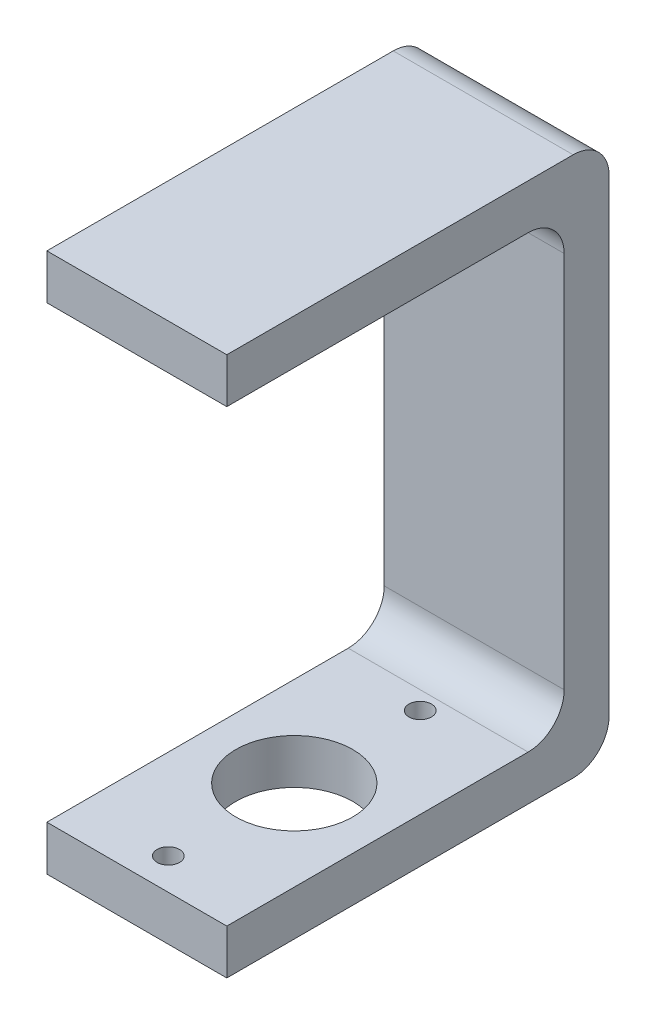
ISO-10303-21;
HEADER;
FILE_DESCRIPTION(('STEP AP214'),'2;1');
FILE_NAME('part.step','',(''),(''),'','','');
FILE_SCHEMA(('AUTOMOTIVE_DESIGN { 1 0 10303 214 1 1 1 1 }'));
ENDSEC;
DATA;
#1=APPLICATION_CONTEXT('core data for automotive mechanical design processes');
#2=APPLICATION_PROTOCOL_DEFINITION('international standard','automotive_design',2000,#1);
#3=PRODUCT_CONTEXT('',#1,'mechanical');
#4=PRODUCT('Part','Part','',(#3));
#5=PRODUCT_RELATED_PRODUCT_CATEGORY('part','',(#4));
#6=PRODUCT_DEFINITION_FORMATION('','',#4);
#7=PRODUCT_DEFINITION_CONTEXT('part definition',#1,'design');
#8=PRODUCT_DEFINITION('design','',#6,#7);
#9=PRODUCT_DEFINITION_SHAPE('','',#8);
#10=(LENGTH_UNIT() NAMED_UNIT(*) SI_UNIT(.MILLI.,.METRE.));
#11=(NAMED_UNIT(*) PLANE_ANGLE_UNIT() SI_UNIT($,.RADIAN.));
#12=(NAMED_UNIT(*) SI_UNIT($,.STERADIAN.) SOLID_ANGLE_UNIT());
#13=UNCERTAINTY_MEASURE_WITH_UNIT(LENGTH_MEASURE(1.E-05),#10,'distance_accuracy_value','');
#14=(GEOMETRIC_REPRESENTATION_CONTEXT(3) GLOBAL_UNCERTAINTY_ASSIGNED_CONTEXT((#13)) GLOBAL_UNIT_ASSIGNED_CONTEXT((#10,
#11,#12)) REPRESENTATION_CONTEXT('',''));
#15=CARTESIAN_POINT('',(0.,0.,0.));
#16=DIRECTION('',(0.,0.,1.));
#17=DIRECTION('',(1.,0.,0.));
#18=AXIS2_PLACEMENT_3D('',#15,#16,#17);
#19=CARTESIAN_POINT('',(40.,0.,0.));
#20=DIRECTION('',(0.,1.,0.));
#21=DIRECTION('',(0.,0.,1.));
#22=AXIS2_PLACEMENT_3D('',#19,#20,#21);
#23=PLANE('',#22);
#24=DIRECTION('',(0.,0.,-1.));
#25=VECTOR('',#24,1.);
#26=CARTESIAN_POINT('',(0.,0.,0.));
#27=LINE('',#26,#25);
#28=CARTESIAN_POINT('',(0.,0.,0.));
#29=VERTEX_POINT('',#28);
#30=CARTESIAN_POINT('',(0.,0.,-77.));
#31=VERTEX_POINT('',#30);
#32=EDGE_CURVE('E159',#29,#31,#27,.T.);
#33=ORIENTED_EDGE('',*,*,#32,.T.);
#34=DIRECTION('',(-1.,0.,0.));
#35=VECTOR('',#34,1.);
#36=CARTESIAN_POINT('',(40.,0.,-77.));
#37=LINE('',#36,#35);
#38=CARTESIAN_POINT('',(40.,0.,-77.));
#39=VERTEX_POINT('',#38);
#40=EDGE_CURVE('E44',#39,#31,#37,.T.);
#41=ORIENTED_EDGE('',*,*,#40,.F.);
#42=DIRECTION('',(0.,0.,-1.));
#43=VECTOR('',#42,1.);
#44=CARTESIAN_POINT('',(40.,0.,0.));
#45=LINE('',#44,#43);
#46=CARTESIAN_POINT('',(40.,0.,0.));
#47=VERTEX_POINT('',#46);
#48=EDGE_CURVE('E107',#47,#39,#45,.T.);
#49=ORIENTED_EDGE('',*,*,#48,.F.);
#50=DIRECTION('',(-1.,0.,0.));
#51=VECTOR('',#50,1.);
#52=CARTESIAN_POINT('',(40.,0.,0.));
#53=LINE('',#52,#51);
#54=EDGE_CURVE('E11',#47,#29,#53,.T.);
#55=ORIENTED_EDGE('',*,*,#54,.T.);
#56=EDGE_LOOP('',(#33,#41,#49,#55));
#57=FACE_BOUND('',#56,.T.);
#58=CARTESIAN_POINT('',(20.,0.,-35.));
#59=DIRECTION('',(0.,-1.,0.));
#60=DIRECTION('',(0.,0.,-1.));
#61=AXIS2_PLACEMENT_3D('',#58,#59,#60);
#62=CIRCLE('',#61,13.);
#63=CARTESIAN_POINT('',(20.,0.,-48.));
#64=VERTEX_POINT('',#63);
#65=EDGE_CURVE('E160',#64,#64,#62,.T.);
#66=ORIENTED_EDGE('',*,*,#65,.F.);
#67=EDGE_LOOP('',(#66));
#68=FACE_BOUND('',#67,.T.);
#69=CARTESIAN_POINT('',(20.,0.,-63.));
#70=DIRECTION('',(0.,-1.,0.));
#71=DIRECTION('',(0.,0.,-1.));
#72=AXIS2_PLACEMENT_3D('',#69,#70,#71);
#73=CIRCLE('',#72,2.5);
#74=CARTESIAN_POINT('',(20.,0.,-65.5));
#75=VERTEX_POINT('',#74);
#76=EDGE_CURVE('E359',#75,#75,#73,.T.);
#77=ORIENTED_EDGE('',*,*,#76,.F.);
#78=EDGE_LOOP('',(#77));
#79=FACE_BOUND('',#78,.T.);
#80=CARTESIAN_POINT('',(20.,0.,-7.00000000000001));
#81=DIRECTION('',(0.,-1.,0.));
#82=DIRECTION('',(0.,0.,-1.));
#83=AXIS2_PLACEMENT_3D('',#80,#81,#82);
#84=CIRCLE('',#83,2.5);
#85=CARTESIAN_POINT('',(20.,0.,-9.50000000000001));
#86=VERTEX_POINT('',#85);
#87=EDGE_CURVE('E356',#86,#86,#84,.T.);
#88=ORIENTED_EDGE('',*,*,#87,.F.);
#89=EDGE_LOOP('',(#88));
#90=FACE_BOUND('',#89,.T.);
#91=ADVANCED_FACE('F35',(#57,#68,#79,#90),#23,.F.);
#92=CARTESIAN_POINT('',(40.,10.,0.));
#93=DIRECTION('',(0.,0.,-1.));
#94=DIRECTION('',(0.,1.,0.));
#95=AXIS2_PLACEMENT_3D('',#92,#93,#94);
#96=PLANE('',#95);
#97=DIRECTION('',(0.,-1.,0.));
#98=VECTOR('',#97,1.);
#99=CARTESIAN_POINT('',(0.,10.,0.));
#100=LINE('',#99,#98);
#101=CARTESIAN_POINT('',(0.,10.,0.));
#102=VERTEX_POINT('',#101);
#103=EDGE_CURVE('E156',#102,#29,#100,.T.);
#104=ORIENTED_EDGE('',*,*,#103,.T.);
#105=ORIENTED_EDGE('',*,*,#54,.F.);
#106=DIRECTION('',(0.,-1.,0.));
#107=VECTOR('',#106,1.);
#108=CARTESIAN_POINT('',(40.,10.,0.));
#109=LINE('',#108,#107);
#110=CARTESIAN_POINT('',(40.,10.,0.));
#111=VERTEX_POINT('',#110);
#112=EDGE_CURVE('E179',#111,#47,#109,.T.);
#113=ORIENTED_EDGE('',*,*,#112,.F.);
#114=DIRECTION('',(-1.,0.,0.));
#115=VECTOR('',#114,1.);
#116=CARTESIAN_POINT('',(40.,10.,0.));
#117=LINE('',#116,#115);
#118=EDGE_CURVE('E152',#111,#102,#117,.T.);
#119=ORIENTED_EDGE('',*,*,#118,.T.);
#120=EDGE_LOOP('',(#104,#105,#113,#119));
#121=FACE_BOUND('',#120,.T.);
#122=ADVANCED_FACE('F37',(#121),#96,.F.);
#123=CARTESIAN_POINT('',(40.,8.,-77.));
#124=DIRECTION('',(-1.,0.,0.));
#125=DIRECTION('',(0.,0.,1.));
#126=AXIS2_PLACEMENT_3D('',#123,#124,#125);
#127=CYLINDRICAL_SURFACE('',#126,8.);
#128=CARTESIAN_POINT('',(0.,8.,-77.));
#129=DIRECTION('',(1.,0.,0.));
#130=DIRECTION('',(0.,0.,1.));
#131=AXIS2_PLACEMENT_3D('',#128,#129,#130);
#132=CIRCLE('',#131,8.);
#133=CARTESIAN_POINT('',(0.,8.,-85.));
#134=VERTEX_POINT('',#133);
#135=EDGE_CURVE('E162',#31,#134,#132,.T.);
#136=ORIENTED_EDGE('',*,*,#135,.T.);
#137=DIRECTION('',(-1.,0.,0.));
#138=VECTOR('',#137,1.);
#139=CARTESIAN_POINT('',(40.,8.,-85.));
#140=LINE('',#139,#138);
#141=CARTESIAN_POINT('',(40.,8.,-85.));
#142=VERTEX_POINT('',#141);
#143=EDGE_CURVE('E198',#142,#134,#140,.T.);
#144=ORIENTED_EDGE('',*,*,#143,.F.);
#145=CARTESIAN_POINT('',(40.,8.,-77.));
#146=DIRECTION('',(1.,0.,0.));
#147=DIRECTION('',(0.,0.,1.));
#148=AXIS2_PLACEMENT_3D('',#145,#146,#147);
#149=CIRCLE('',#148,8.);
#150=EDGE_CURVE('E206',#39,#142,#149,.T.);
#151=ORIENTED_EDGE('',*,*,#150,.F.);
#152=ORIENTED_EDGE('',*,*,#40,.T.);
#153=EDGE_LOOP('',(#136,#144,#151,#152));
#154=FACE_BOUND('',#153,.T.);
#155=ADVANCED_FACE('F204',(#154),#127,.T.);
#156=CARTESIAN_POINT('',(40.,8.,-85.));
#157=DIRECTION('',(0.,0.,1.));
#158=DIRECTION('',(1.,0.,0.));
#159=AXIS2_PLACEMENT_3D('',#156,#157,#158);
#160=PLANE('',#159);
#161=DIRECTION('',(0.,1.,0.));
#162=VECTOR('',#161,1.);
#163=CARTESIAN_POINT('',(0.,8.,-85.));
#164=LINE('',#163,#162);
#165=CARTESIAN_POINT('',(0.,112.,-85.));
#166=VERTEX_POINT('',#165);
#167=EDGE_CURVE('E164',#134,#166,#164,.T.);
#168=ORIENTED_EDGE('',*,*,#167,.T.);
#169=DIRECTION('',(-1.,0.,0.));
#170=VECTOR('',#169,1.);
#171=CARTESIAN_POINT('',(40.,112.,-85.));
#172=LINE('',#171,#170);
#173=CARTESIAN_POINT('',(40.,112.,-85.));
#174=VERTEX_POINT('',#173);
#175=EDGE_CURVE('E195',#174,#166,#172,.T.);
#176=ORIENTED_EDGE('',*,*,#175,.F.);
#177=DIRECTION('',(0.,1.,0.));
#178=VECTOR('',#177,1.);
#179=CARTESIAN_POINT('',(40.,8.,-85.));
#180=LINE('',#179,#178);
#181=EDGE_CURVE('E224',#142,#174,#180,.T.);
#182=ORIENTED_EDGE('',*,*,#181,.F.);
#183=ORIENTED_EDGE('',*,*,#143,.T.);
#184=EDGE_LOOP('',(#168,#176,#182,#183));
#185=FACE_BOUND('',#184,.T.);
#186=ADVANCED_FACE('F215',(#185),#160,.F.);
#187=CARTESIAN_POINT('',(40.,112.,-77.));
#188=DIRECTION('',(-1.,0.,0.));
#189=DIRECTION('',(0.,0.,1.));
#190=AXIS2_PLACEMENT_3D('',#187,#188,#189);
#191=CYLINDRICAL_SURFACE('',#190,8.);
#192=CARTESIAN_POINT('',(0.,112.,-77.));
#193=DIRECTION('',(1.,0.,0.));
#194=DIRECTION('',(0.,0.,-1.));
#195=AXIS2_PLACEMENT_3D('',#192,#193,#194);
#196=CIRCLE('',#195,8.);
#197=CARTESIAN_POINT('',(0.,120.,-77.));
#198=VERTEX_POINT('',#197);
#199=EDGE_CURVE('E166',#166,#198,#196,.T.);
#200=ORIENTED_EDGE('',*,*,#199,.T.);
#201=DIRECTION('',(-1.,0.,0.));
#202=VECTOR('',#201,1.);
#203=CARTESIAN_POINT('',(40.,120.,-77.));
#204=LINE('',#203,#202);
#205=CARTESIAN_POINT('',(40.,120.,-77.));
#206=VERTEX_POINT('',#205);
#207=EDGE_CURVE('E192',#206,#198,#204,.T.);
#208=ORIENTED_EDGE('',*,*,#207,.F.);
#209=CARTESIAN_POINT('',(40.,112.,-77.));
#210=DIRECTION('',(1.,0.,0.));
#211=DIRECTION('',(0.,0.,-1.));
#212=AXIS2_PLACEMENT_3D('',#209,#210,#211);
#213=CIRCLE('',#212,8.);
#214=EDGE_CURVE('E221',#174,#206,#213,.T.);
#215=ORIENTED_EDGE('',*,*,#214,.F.);
#216=ORIENTED_EDGE('',*,*,#175,.T.);
#217=EDGE_LOOP('',(#200,#208,#215,#216));
#218=FACE_BOUND('',#217,.T.);
#219=ADVANCED_FACE('F219',(#218),#191,.T.);
#220=CARTESIAN_POINT('',(40.,120.,-77.));
#221=DIRECTION('',(0.,-1.,0.));
#222=DIRECTION('',(0.,0.,-1.));
#223=AXIS2_PLACEMENT_3D('',#220,#221,#222);
#224=PLANE('',#223);
#225=DIRECTION('',(0.,0.,1.));
#226=VECTOR('',#225,1.);
#227=CARTESIAN_POINT('',(0.,120.,-77.));
#228=LINE('',#227,#226);
#229=CARTESIAN_POINT('',(0.,120.,0.));
#230=VERTEX_POINT('',#229);
#231=EDGE_CURVE('E168',#198,#230,#228,.T.);
#232=ORIENTED_EDGE('',*,*,#231,.T.);
#233=DIRECTION('',(-1.,0.,0.));
#234=VECTOR('',#233,1.);
#235=CARTESIAN_POINT('',(40.,120.,0.));
#236=LINE('',#235,#234);
#237=CARTESIAN_POINT('',(40.,120.,0.));
#238=VERTEX_POINT('',#237);
#239=EDGE_CURVE('E189',#238,#230,#236,.T.);
#240=ORIENTED_EDGE('',*,*,#239,.F.);
#241=DIRECTION('',(0.,0.,1.));
#242=VECTOR('',#241,1.);
#243=CARTESIAN_POINT('',(40.,120.,-77.));
#244=LINE('',#243,#242);
#245=EDGE_CURVE('E223',#206,#238,#244,.T.);
#246=ORIENTED_EDGE('',*,*,#245,.F.);
#247=ORIENTED_EDGE('',*,*,#207,.T.);
#248=EDGE_LOOP('',(#232,#240,#246,#247));
#249=FACE_BOUND('',#248,.T.);
#250=ADVANCED_FACE('F271',(#249),#224,.F.);
#251=CARTESIAN_POINT('',(40.,120.,0.));
#252=DIRECTION('',(0.,0.,-1.));
#253=DIRECTION('',(0.,1.,0.));
#254=AXIS2_PLACEMENT_3D('',#251,#252,#253);
#255=PLANE('',#254);
#256=DIRECTION('',(0.,-1.,0.));
#257=VECTOR('',#256,1.);
#258=CARTESIAN_POINT('',(0.,120.,0.));
#259=LINE('',#258,#257);
#260=CARTESIAN_POINT('',(0.,110.,0.));
#261=VERTEX_POINT('',#260);
#262=EDGE_CURVE('E170',#230,#261,#259,.T.);
#263=ORIENTED_EDGE('',*,*,#262,.T.);
#264=DIRECTION('',(-1.,0.,0.));
#265=VECTOR('',#264,1.);
#266=CARTESIAN_POINT('',(40.,110.,0.));
#267=LINE('',#266,#265);
#268=CARTESIAN_POINT('',(40.,110.,0.));
#269=VERTEX_POINT('',#268);
#270=EDGE_CURVE('E186',#269,#261,#267,.T.);
#271=ORIENTED_EDGE('',*,*,#270,.F.);
#272=DIRECTION('',(0.,-1.,0.));
#273=VECTOR('',#272,1.);
#274=CARTESIAN_POINT('',(40.,120.,0.));
#275=LINE('',#274,#273);
#276=EDGE_CURVE('E226',#238,#269,#275,.T.);
#277=ORIENTED_EDGE('',*,*,#276,.F.);
#278=ORIENTED_EDGE('',*,*,#239,.T.);
#279=EDGE_LOOP('',(#263,#271,#277,#278));
#280=FACE_BOUND('',#279,.T.);
#281=ADVANCED_FACE('F274',(#280),#255,.F.);
#282=CARTESIAN_POINT('',(40.,110.,0.));
#283=DIRECTION('',(0.,1.,0.));
#284=DIRECTION('',(0.,0.,1.));
#285=AXIS2_PLACEMENT_3D('',#282,#283,#284);
#286=PLANE('',#285);
#287=DIRECTION('',(0.,0.,-1.));
#288=VECTOR('',#287,1.);
#289=CARTESIAN_POINT('',(0.,110.,0.));
#290=LINE('',#289,#288);
#291=CARTESIAN_POINT('',(0.,110.,-67.));
#292=VERTEX_POINT('',#291);
#293=EDGE_CURVE('E172',#261,#292,#290,.T.);
#294=ORIENTED_EDGE('',*,*,#293,.T.);
#295=DIRECTION('',(-1.,0.,0.));
#296=VECTOR('',#295,1.);
#297=CARTESIAN_POINT('',(40.,110.,-67.));
#298=LINE('',#297,#296);
#299=CARTESIAN_POINT('',(40.,110.,-67.));
#300=VERTEX_POINT('',#299);
#301=EDGE_CURVE('E183',#300,#292,#298,.T.);
#302=ORIENTED_EDGE('',*,*,#301,.F.);
#303=DIRECTION('',(0.,0.,-1.));
#304=VECTOR('',#303,1.);
#305=CARTESIAN_POINT('',(40.,110.,0.));
#306=LINE('',#305,#304);
#307=EDGE_CURVE('E232',#269,#300,#306,.T.);
#308=ORIENTED_EDGE('',*,*,#307,.F.);
#309=ORIENTED_EDGE('',*,*,#270,.T.);
#310=EDGE_LOOP('',(#294,#302,#308,#309));
#311=FACE_BOUND('',#310,.T.);
#312=ADVANCED_FACE('F238',(#311),#286,.F.);
#313=CARTESIAN_POINT('',(40.,102.,-67.));
#314=DIRECTION('',(-1.,0.,0.));
#315=DIRECTION('',(0.,0.,1.));
#316=AXIS2_PLACEMENT_3D('',#313,#314,#315);
#317=CYLINDRICAL_SURFACE('',#316,8.00000000000001);
#318=CARTESIAN_POINT('',(0.,102.,-67.));
#319=DIRECTION('',(-1.,0.,0.));
#320=DIRECTION('',(0.,0.,-1.));
#321=AXIS2_PLACEMENT_3D('',#318,#319,#320);
#322=CIRCLE('',#321,8.00000000000001);
#323=CARTESIAN_POINT('',(0.,102.,-75.));
#324=VERTEX_POINT('',#323);
#325=EDGE_CURVE('E174',#292,#324,#322,.T.);
#326=ORIENTED_EDGE('',*,*,#325,.T.);
#327=DIRECTION('',(-1.,0.,0.));
#328=VECTOR('',#327,1.);
#329=CARTESIAN_POINT('',(40.,102.,-75.));
#330=LINE('',#329,#328);
#331=CARTESIAN_POINT('',(40.,102.,-75.));
#332=VERTEX_POINT('',#331);
#333=EDGE_CURVE('E147',#332,#324,#330,.T.);
#334=ORIENTED_EDGE('',*,*,#333,.F.);
#335=CARTESIAN_POINT('',(40.,102.,-67.));
#336=DIRECTION('',(-1.,0.,0.));
#337=DIRECTION('',(0.,0.,-1.));
#338=AXIS2_PLACEMENT_3D('',#335,#336,#337);
#339=CIRCLE('',#338,8.00000000000001);
#340=EDGE_CURVE('E138',#300,#332,#339,.T.);
#341=ORIENTED_EDGE('',*,*,#340,.F.);
#342=ORIENTED_EDGE('',*,*,#301,.T.);
#343=EDGE_LOOP('',(#326,#334,#341,#342));
#344=FACE_BOUND('',#343,.T.);
#345=ADVANCED_FACE('F242',(#344),#317,.F.);
#346=CARTESIAN_POINT('',(40.,102.,-75.));
#347=DIRECTION('',(0.,0.,-1.));
#348=DIRECTION('',(0.,1.,0.));
#349=AXIS2_PLACEMENT_3D('',#346,#347,#348);
#350=PLANE('',#349);
#351=DIRECTION('',(0.,-1.,0.));
#352=VECTOR('',#351,1.);
#353=CARTESIAN_POINT('',(0.,102.,-75.));
#354=LINE('',#353,#352);
#355=CARTESIAN_POINT('',(0.,18.,-75.));
#356=VERTEX_POINT('',#355);
#357=EDGE_CURVE('E146',#324,#356,#354,.T.);
#358=ORIENTED_EDGE('',*,*,#357,.T.);
#359=DIRECTION('',(-1.,0.,0.));
#360=VECTOR('',#359,1.);
#361=CARTESIAN_POINT('',(40.,18.,-75.));
#362=LINE('',#361,#360);
#363=CARTESIAN_POINT('',(40.,18.,-75.));
#364=VERTEX_POINT('',#363);
#365=EDGE_CURVE('E143',#364,#356,#362,.T.);
#366=ORIENTED_EDGE('',*,*,#365,.F.);
#367=DIRECTION('',(0.,-1.,0.));
#368=VECTOR('',#367,1.);
#369=CARTESIAN_POINT('',(40.,102.,-75.));
#370=LINE('',#369,#368);
#371=EDGE_CURVE('E132',#332,#364,#370,.T.);
#372=ORIENTED_EDGE('',*,*,#371,.F.);
#373=ORIENTED_EDGE('',*,*,#333,.T.);
#374=EDGE_LOOP('',(#358,#366,#372,#373));
#375=FACE_BOUND('',#374,.T.);
#376=ADVANCED_FACE('F144',(#375),#350,.F.);
#377=CARTESIAN_POINT('',(40.,18.,-67.));
#378=DIRECTION('',(-1.,0.,0.));
#379=DIRECTION('',(0.,0.,1.));
#380=AXIS2_PLACEMENT_3D('',#377,#378,#379);
#381=CYLINDRICAL_SURFACE('',#380,8.);
#382=CARTESIAN_POINT('',(0.,18.,-67.));
#383=DIRECTION('',(-1.,0.,0.));
#384=DIRECTION('',(0.,0.,-1.));
#385=AXIS2_PLACEMENT_3D('',#382,#383,#384);
#386=CIRCLE('',#385,8.);
#387=CARTESIAN_POINT('',(0.,10.,-67.));
#388=VERTEX_POINT('',#387);
#389=EDGE_CURVE('E93',#356,#388,#386,.T.);
#390=ORIENTED_EDGE('',*,*,#389,.T.);
#391=DIRECTION('',(-1.,0.,0.));
#392=VECTOR('',#391,1.);
#393=CARTESIAN_POINT('',(40.,10.,-67.));
#394=LINE('',#393,#392);
#395=CARTESIAN_POINT('',(40.,10.,-67.));
#396=VERTEX_POINT('',#395);
#397=EDGE_CURVE('E148',#396,#388,#394,.T.);
#398=ORIENTED_EDGE('',*,*,#397,.F.);
#399=CARTESIAN_POINT('',(40.,18.,-67.));
#400=DIRECTION('',(-1.,0.,0.));
#401=DIRECTION('',(0.,0.,-1.));
#402=AXIS2_PLACEMENT_3D('',#399,#400,#401);
#403=CIRCLE('',#402,8.);
#404=EDGE_CURVE('E136',#364,#396,#403,.T.);
#405=ORIENTED_EDGE('',*,*,#404,.F.);
#406=ORIENTED_EDGE('',*,*,#365,.T.);
#407=EDGE_LOOP('',(#390,#398,#405,#406));
#408=FACE_BOUND('',#407,.T.);
#409=ADVANCED_FACE('F150',(#408),#381,.F.);
#410=CARTESIAN_POINT('',(40.,10.,-67.));
#411=DIRECTION('',(0.,-1.,0.));
#412=DIRECTION('',(0.,0.,-1.));
#413=AXIS2_PLACEMENT_3D('',#410,#411,#412);
#414=PLANE('',#413);
#415=CARTESIAN_POINT('',(20.,10.,-7.00000000000001));
#416=DIRECTION('',(0.,-1.,0.));
#417=DIRECTION('',(0.,0.,-1.));
#418=AXIS2_PLACEMENT_3D('',#415,#416,#417);
#419=CIRCLE('',#418,2.5);
#420=CARTESIAN_POINT('',(20.,10.,-9.50000000000001));
#421=VERTEX_POINT('',#420);
#422=EDGE_CURVE('E353',#421,#421,#419,.T.);
#423=ORIENTED_EDGE('',*,*,#422,.T.);
#424=EDGE_LOOP('',(#423));
#425=FACE_BOUND('',#424,.T.);
#426=CARTESIAN_POINT('',(20.,10.,-63.));
#427=DIRECTION('',(0.,-1.,0.));
#428=DIRECTION('',(0.,0.,-1.));
#429=AXIS2_PLACEMENT_3D('',#426,#427,#428);
#430=CIRCLE('',#429,2.5);
#431=CARTESIAN_POINT('',(20.,10.,-65.5));
#432=VERTEX_POINT('',#431);
#433=EDGE_CURVE('E364',#432,#432,#430,.T.);
#434=ORIENTED_EDGE('',*,*,#433,.T.);
#435=EDGE_LOOP('',(#434));
#436=FACE_BOUND('',#435,.T.);
#437=CARTESIAN_POINT('',(20.,10.,-35.));
#438=DIRECTION('',(0.,-1.,0.));
#439=DIRECTION('',(0.,0.,-1.));
#440=AXIS2_PLACEMENT_3D('',#437,#438,#439);
#441=CIRCLE('',#440,13.);
#442=CARTESIAN_POINT('',(20.,10.,-48.));
#443=VERTEX_POINT('',#442);
#444=EDGE_CURVE('E367',#443,#443,#441,.F.);
#445=ORIENTED_EDGE('',*,*,#444,.F.);
#446=EDGE_LOOP('',(#445));
#447=FACE_BOUND('',#446,.T.);
#448=DIRECTION('',(0.,0.,1.));
#449=VECTOR('',#448,1.);
#450=CARTESIAN_POINT('',(0.,10.,-67.));
#451=LINE('',#450,#449);
#452=EDGE_CURVE('E99',#388,#102,#451,.T.);
#453=ORIENTED_EDGE('',*,*,#452,.T.);
#454=ORIENTED_EDGE('',*,*,#118,.F.);
#455=DIRECTION('',(0.,0.,1.));
#456=VECTOR('',#455,1.);
#457=CARTESIAN_POINT('',(40.,10.,-67.));
#458=LINE('',#457,#456);
#459=EDGE_CURVE('E52',#396,#111,#458,.T.);
#460=ORIENTED_EDGE('',*,*,#459,.F.);
#461=ORIENTED_EDGE('',*,*,#397,.T.);
#462=EDGE_LOOP('',(#453,#454,#460,#461));
#463=FACE_BOUND('',#462,.T.);
#464=ADVANCED_FACE('F246',(#425,#436,#447,#463),#414,.F.);
#465=CARTESIAN_POINT('',(40.,8.,-77.));
#466=DIRECTION('',(-1.,0.,0.));
#467=DIRECTION('',(0.,0.,1.));
#468=AXIS2_PLACEMENT_3D('',#465,#466,#467);
#469=PLANE('',#468);
#470=ORIENTED_EDGE('',*,*,#112,.T.);
#471=ORIENTED_EDGE('',*,*,#48,.T.);
#472=ORIENTED_EDGE('',*,*,#150,.T.);
#473=ORIENTED_EDGE('',*,*,#181,.T.);
#474=ORIENTED_EDGE('',*,*,#214,.T.);
#475=ORIENTED_EDGE('',*,*,#245,.T.);
#476=ORIENTED_EDGE('',*,*,#276,.T.);
#477=ORIENTED_EDGE('',*,*,#307,.T.);
#478=ORIENTED_EDGE('',*,*,#340,.T.);
#479=ORIENTED_EDGE('',*,*,#371,.T.);
#480=ORIENTED_EDGE('',*,*,#404,.T.);
#481=ORIENTED_EDGE('',*,*,#459,.T.);
#482=EDGE_LOOP('',(#470,#471,#472,#473,#474,#475,#476,#477,#478,#479,#480,#481));
#483=FACE_BOUND('',#482,.T.);
#484=ADVANCED_FACE('F134',(#483),#469,.F.);
#485=CARTESIAN_POINT('',(0.,8.,-77.));
#486=DIRECTION('',(-1.,0.,0.));
#487=DIRECTION('',(0.,0.,1.));
#488=AXIS2_PLACEMENT_3D('',#485,#486,#487);
#489=PLANE('',#488);
#490=ORIENTED_EDGE('',*,*,#103,.F.);
#491=ORIENTED_EDGE('',*,*,#452,.F.);
#492=ORIENTED_EDGE('',*,*,#389,.F.);
#493=ORIENTED_EDGE('',*,*,#357,.F.);
#494=ORIENTED_EDGE('',*,*,#325,.F.);
#495=ORIENTED_EDGE('',*,*,#293,.F.);
#496=ORIENTED_EDGE('',*,*,#262,.F.);
#497=ORIENTED_EDGE('',*,*,#231,.F.);
#498=ORIENTED_EDGE('',*,*,#199,.F.);
#499=ORIENTED_EDGE('',*,*,#167,.F.);
#500=ORIENTED_EDGE('',*,*,#135,.F.);
#501=ORIENTED_EDGE('',*,*,#32,.F.);
#502=EDGE_LOOP('',(#490,#491,#492,#493,#494,#495,#496,#497,#498,#499,#500,#501));
#503=FACE_BOUND('',#502,.T.);
#504=ADVANCED_FACE('F210',(#503),#489,.T.);
#505=CARTESIAN_POINT('',(20.,120.001,-35.));
#506=DIRECTION('',(0.,-1.,0.));
#507=DIRECTION('',(0.,0.,-1.));
#508=AXIS2_PLACEMENT_3D('',#505,#506,#507);
#509=CYLINDRICAL_SURFACE('',#508,13.);
#510=ORIENTED_EDGE('',*,*,#65,.T.);
#511=EDGE_LOOP('',(#510));
#512=FACE_BOUND('',#511,.T.);
#513=ORIENTED_EDGE('',*,*,#444,.T.);
#514=EDGE_LOOP('',(#513));
#515=FACE_BOUND('',#514,.T.);
#516=ADVANCED_FACE('F308',(#512,#515),#509,.F.);
#517=CARTESIAN_POINT('',(20.,0.,-63.));
#518=DIRECTION('',(0.,-1.,0.));
#519=DIRECTION('',(0.,0.,-1.));
#520=AXIS2_PLACEMENT_3D('',#517,#518,#519);
#521=CYLINDRICAL_SURFACE('',#520,2.5);
#522=ORIENTED_EDGE('',*,*,#433,.F.);
#523=EDGE_LOOP('',(#522));
#524=FACE_BOUND('',#523,.T.);
#525=ORIENTED_EDGE('',*,*,#76,.T.);
#526=EDGE_LOOP('',(#525));
#527=FACE_BOUND('',#526,.T.);
#528=ADVANCED_FACE('F315',(#524,#527),#521,.F.);
#529=CARTESIAN_POINT('',(20.,0.,-7.00000000000001));
#530=DIRECTION('',(0.,-1.,0.));
#531=DIRECTION('',(0.,0.,-1.));
#532=AXIS2_PLACEMENT_3D('',#529,#530,#531);
#533=CYLINDRICAL_SURFACE('',#532,2.5);
#534=ORIENTED_EDGE('',*,*,#422,.F.);
#535=EDGE_LOOP('',(#534));
#536=FACE_BOUND('',#535,.T.);
#537=ORIENTED_EDGE('',*,*,#87,.T.);
#538=EDGE_LOOP('',(#537));
#539=FACE_BOUND('',#538,.T.);
#540=ADVANCED_FACE('F334',(#536,#539),#533,.F.);
#541=CLOSED_SHELL('',(#91,#122,#155,#186,#219,#250,#281,#312,#345,#376,#409,#464,#484,#504,#516,
#528,#540));
#542=MANIFOLD_SOLID_BREP('B2',#541);
#543=ADVANCED_BREP_SHAPE_REPRESENTATION('',(#18,#542),#14);
#544=SHAPE_DEFINITION_REPRESENTATION(#9,#543);
ENDSEC;
END-ISO-10303-21;
